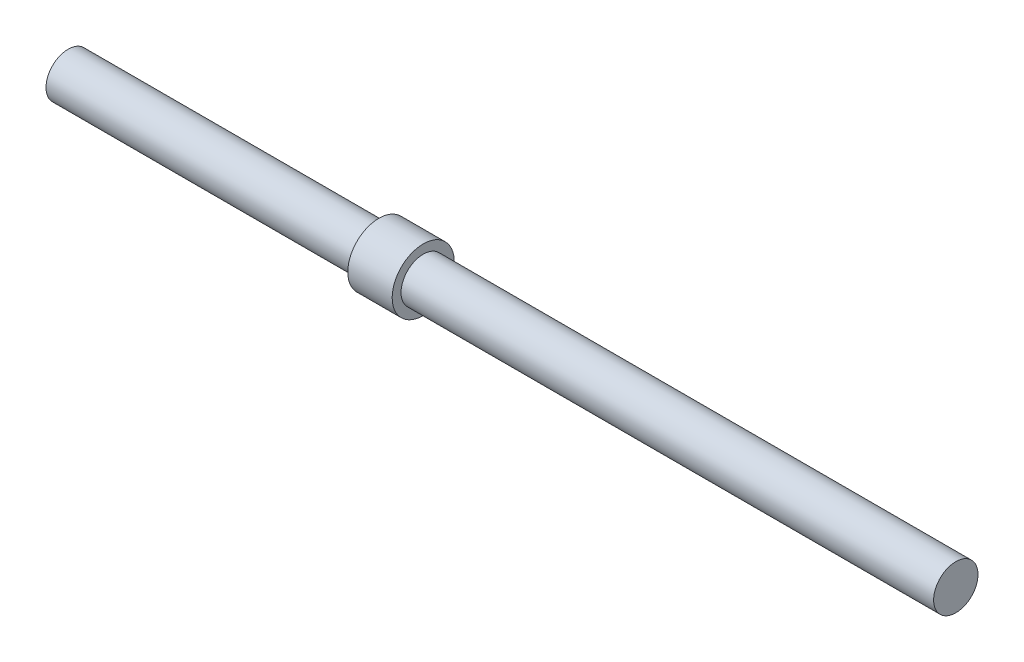
ISO-10303-21;
HEADER;
FILE_DESCRIPTION(('STEP AP214'),'2;1');
FILE_NAME('part.step','',(''),(''),'','','');
FILE_SCHEMA(('AUTOMOTIVE_DESIGN { 1 0 10303 214 1 1 1 1 }'));
ENDSEC;
DATA;
#1=APPLICATION_CONTEXT('core data for automotive mechanical design processes');
#2=APPLICATION_PROTOCOL_DEFINITION('international standard','automotive_design',2000,#1);
#3=PRODUCT_CONTEXT('',#1,'mechanical');
#4=PRODUCT('Part','Part','',(#3));
#5=PRODUCT_RELATED_PRODUCT_CATEGORY('part','',(#4));
#6=PRODUCT_DEFINITION_FORMATION('','',#4);
#7=PRODUCT_DEFINITION_CONTEXT('part definition',#1,'design');
#8=PRODUCT_DEFINITION('design','',#6,#7);
#9=PRODUCT_DEFINITION_SHAPE('','',#8);
#10=(LENGTH_UNIT() NAMED_UNIT(*) SI_UNIT(.MILLI.,.METRE.));
#11=(NAMED_UNIT(*) PLANE_ANGLE_UNIT() SI_UNIT($,.RADIAN.));
#12=(NAMED_UNIT(*) SI_UNIT($,.STERADIAN.) SOLID_ANGLE_UNIT());
#13=UNCERTAINTY_MEASURE_WITH_UNIT(LENGTH_MEASURE(1.E-05),#10,'distance_accuracy_value','');
#14=(GEOMETRIC_REPRESENTATION_CONTEXT(3) GLOBAL_UNCERTAINTY_ASSIGNED_CONTEXT((#13)) GLOBAL_UNIT_ASSIGNED_CONTEXT((#10,
#11,#12)) REPRESENTATION_CONTEXT('',''));
#15=CARTESIAN_POINT('',(0.,0.,0.));
#16=DIRECTION('',(0.,0.,1.));
#17=DIRECTION('',(1.,0.,0.));
#18=AXIS2_PLACEMENT_3D('',#15,#16,#17);
#19=CARTESIAN_POINT('',(100.,0.,0.));
#20=DIRECTION('',(-1.,0.,0.));
#21=DIRECTION('',(0.,0.,1.));
#22=AXIS2_PLACEMENT_3D('',#19,#20,#21);
#23=CYLINDRICAL_SURFACE('',#22,5.);
#24=CARTESIAN_POINT('',(100.,0.,0.));
#25=DIRECTION('',(1.,0.,0.));
#26=DIRECTION('',(0.,0.,-1.));
#27=AXIS2_PLACEMENT_3D('',#24,#25,#26);
#28=CIRCLE('',#27,5.);
#29=CARTESIAN_POINT('',(100.,0.,-5.));
#30=VERTEX_POINT('',#29);
#31=EDGE_CURVE('E42',#30,#30,#28,.T.);
#32=ORIENTED_EDGE('',*,*,#31,.F.);
#33=EDGE_LOOP('',(#32));
#34=FACE_BOUND('',#33,.T.);
#35=CARTESIAN_POINT('',(-20.,0.,0.));
#36=DIRECTION('',(-1.,0.,0.));
#37=DIRECTION('',(0.,0.,1.));
#38=AXIS2_PLACEMENT_3D('',#35,#36,#37);
#39=CIRCLE('',#38,5.);
#40=CARTESIAN_POINT('',(-20.,0.,5.));
#41=VERTEX_POINT('',#40);
#42=EDGE_CURVE('E10',#41,#41,#39,.T.);
#43=ORIENTED_EDGE('',*,*,#42,.F.);
#44=EDGE_LOOP('',(#43));
#45=FACE_BOUND('',#44,.T.);
#46=ADVANCED_FACE('F35',(#34,#45),#23,.T.);
#47=CARTESIAN_POINT('',(100.,0.,0.));
#48=DIRECTION('',(1.,0.,0.));
#49=DIRECTION('',(0.,0.,-1.));
#50=AXIS2_PLACEMENT_3D('',#47,#48,#49);
#51=PLANE('',#50);
#52=ORIENTED_EDGE('',*,*,#31,.T.);
#53=EDGE_LOOP('',(#52));
#54=FACE_BOUND('',#53,.T.);
#55=ADVANCED_FACE('F71',(#54),#51,.T.);
#56=CARTESIAN_POINT('',(-20.,0.,0.));
#57=DIRECTION('',(-1.,0.,0.));
#58=DIRECTION('',(0.,0.,1.));
#59=AXIS2_PLACEMENT_3D('',#56,#57,#58);
#60=CYLINDRICAL_SURFACE('',#59,7.);
#61=CARTESIAN_POINT('',(-20.,0.,0.));
#62=DIRECTION('',(-1.,0.,0.));
#63=DIRECTION('',(0.,0.,1.));
#64=AXIS2_PLACEMENT_3D('',#61,#62,#63);
#65=CIRCLE('',#64,7.);
#66=CARTESIAN_POINT('',(-20.,0.,7.));
#67=VERTEX_POINT('',#66);
#68=EDGE_CURVE('E57',#67,#67,#65,.T.);
#69=ORIENTED_EDGE('',*,*,#68,.T.);
#70=EDGE_LOOP('',(#69));
#71=FACE_BOUND('',#70,.T.);
#72=CARTESIAN_POINT('',(-30.,0.,0.));
#73=DIRECTION('',(-1.,0.,0.));
#74=DIRECTION('',(0.,0.,1.));
#75=AXIS2_PLACEMENT_3D('',#72,#73,#74);
#76=CIRCLE('',#75,7.);
#77=CARTESIAN_POINT('',(-30.,0.,7.));
#78=VERTEX_POINT('',#77);
#79=EDGE_CURVE('E54',#78,#78,#76,.T.);
#80=ORIENTED_EDGE('',*,*,#79,.F.);
#81=EDGE_LOOP('',(#80));
#82=FACE_BOUND('',#81,.T.);
#83=ADVANCED_FACE('F68',(#71,#82),#60,.T.);
#84=CARTESIAN_POINT('',(-20.,0.,0.));
#85=DIRECTION('',(-1.,0.,0.));
#86=DIRECTION('',(0.,0.,1.));
#87=AXIS2_PLACEMENT_3D('',#84,#85,#86);
#88=PLANE('',#87);
#89=ORIENTED_EDGE('',*,*,#42,.T.);
#90=EDGE_LOOP('',(#89));
#91=FACE_BOUND('',#90,.T.);
#92=ORIENTED_EDGE('',*,*,#68,.F.);
#93=EDGE_LOOP('',(#92));
#94=FACE_BOUND('',#93,.T.);
#95=ADVANCED_FACE('F70',(#91,#94),#88,.F.);
#96=CARTESIAN_POINT('',(-30.,0.,0.));
#97=DIRECTION('',(-1.,0.,0.));
#98=DIRECTION('',(0.,0.,1.));
#99=AXIS2_PLACEMENT_3D('',#96,#97,#98);
#100=PLANE('',#99);
#101=CARTESIAN_POINT('',(-30.,0.,0.));
#102=DIRECTION('',(-1.,0.,0.));
#103=DIRECTION('',(0.,0.,1.));
#104=AXIS2_PLACEMENT_3D('',#101,#102,#103);
#105=CIRCLE('',#104,5.);
#106=CARTESIAN_POINT('',(-30.,0.,5.));
#107=VERTEX_POINT('',#106);
#108=EDGE_CURVE('E51',#107,#107,#105,.T.);
#109=ORIENTED_EDGE('',*,*,#108,.F.);
#110=EDGE_LOOP('',(#109));
#111=FACE_BOUND('',#110,.T.);
#112=ORIENTED_EDGE('',*,*,#79,.T.);
#113=EDGE_LOOP('',(#112));
#114=FACE_BOUND('',#113,.T.);
#115=ADVANCED_FACE('F66',(#111,#114),#100,.T.);
#116=CARTESIAN_POINT('',(-100.,0.,0.));
#117=DIRECTION('',(1.,0.,0.));
#118=DIRECTION('',(0.,0.,-1.));
#119=AXIS2_PLACEMENT_3D('',#116,#117,#118);
#120=PLANE('',#119);
#121=CARTESIAN_POINT('',(-100.,0.,0.));
#122=DIRECTION('',(1.,0.,0.));
#123=DIRECTION('',(0.,0.,-1.));
#124=AXIS2_PLACEMENT_3D('',#121,#122,#123);
#125=CIRCLE('',#124,5.);
#126=CARTESIAN_POINT('',(-100.,0.,-5.));
#127=VERTEX_POINT('',#126);
#128=EDGE_CURVE('E46',#127,#127,#125,.T.);
#129=ORIENTED_EDGE('',*,*,#128,.F.);
#130=EDGE_LOOP('',(#129));
#131=FACE_BOUND('',#130,.T.);
#132=ADVANCED_FACE('F86',(#131),#120,.F.);
#133=ORIENTED_EDGE('',*,*,#108,.T.);
#134=EDGE_LOOP('',(#133));
#135=FACE_BOUND('',#134,.T.);
#136=ORIENTED_EDGE('',*,*,#128,.T.);
#137=EDGE_LOOP('',(#136));
#138=FACE_BOUND('',#137,.T.);
#139=ADVANCED_FACE('F37',(#135,#138),#23,.T.);
#140=CLOSED_SHELL('',(#46,#55,#83,#95,#115,#132,#139));
#141=MANIFOLD_SOLID_BREP('B2',#140);
#142=ADVANCED_BREP_SHAPE_REPRESENTATION('',(#18,#141),#14);
#143=SHAPE_DEFINITION_REPRESENTATION(#9,#142);
ENDSEC;
END-ISO-10303-21;
